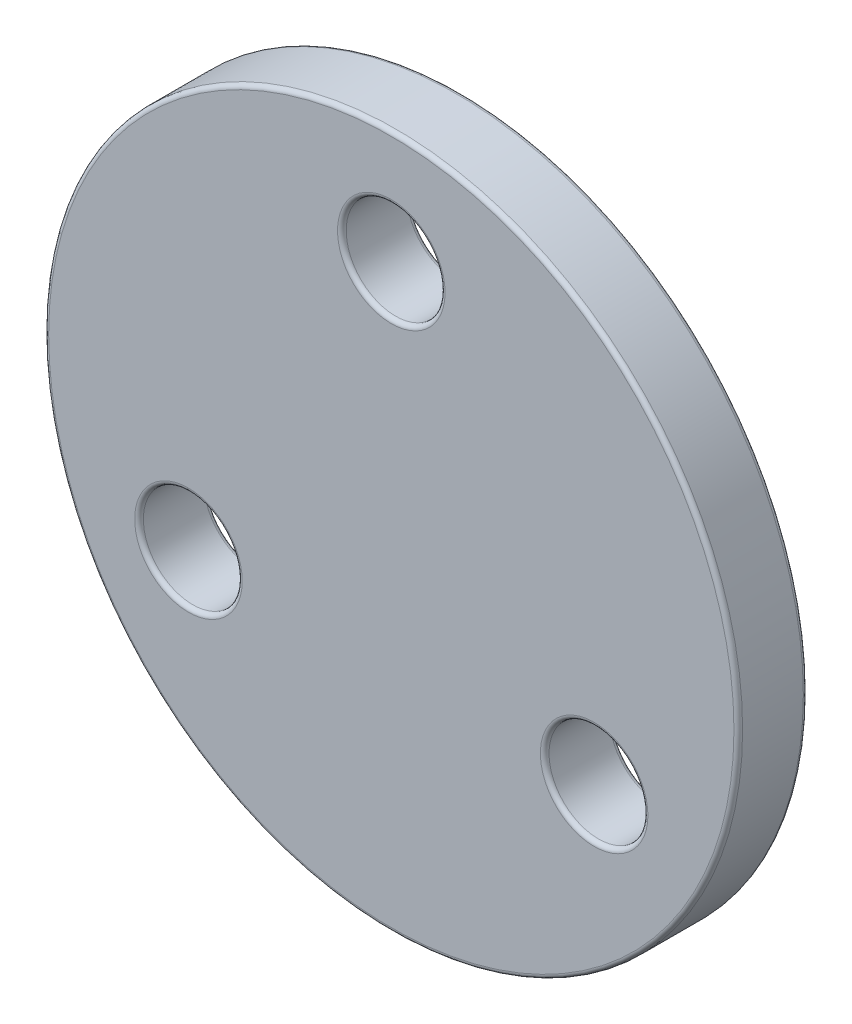
ISO-10303-21;
HEADER;
FILE_DESCRIPTION(('STEP AP214'),'2;1');
FILE_NAME('part.step','',(''),(''),'','','');
FILE_SCHEMA(('AUTOMOTIVE_DESIGN { 1 0 10303 214 1 1 1 1 }'));
ENDSEC;
DATA;
#1=APPLICATION_CONTEXT('core data for automotive mechanical design processes');
#2=APPLICATION_PROTOCOL_DEFINITION('international standard','automotive_design',2000,#1);
#3=PRODUCT_CONTEXT('',#1,'mechanical');
#4=PRODUCT('Part','Part','',(#3));
#5=PRODUCT_RELATED_PRODUCT_CATEGORY('part','',(#4));
#6=PRODUCT_DEFINITION_FORMATION('','',#4);
#7=PRODUCT_DEFINITION_CONTEXT('part definition',#1,'design');
#8=PRODUCT_DEFINITION('design','',#6,#7);
#9=PRODUCT_DEFINITION_SHAPE('','',#8);
#10=(LENGTH_UNIT() NAMED_UNIT(*) SI_UNIT(.MILLI.,.METRE.));
#11=(NAMED_UNIT(*) PLANE_ANGLE_UNIT() SI_UNIT($,.RADIAN.));
#12=(NAMED_UNIT(*) SI_UNIT($,.STERADIAN.) SOLID_ANGLE_UNIT());
#13=UNCERTAINTY_MEASURE_WITH_UNIT(LENGTH_MEASURE(1.E-05),#10,'distance_accuracy_value','');
#14=(GEOMETRIC_REPRESENTATION_CONTEXT(3) GLOBAL_UNCERTAINTY_ASSIGNED_CONTEXT((#13)) GLOBAL_UNIT_ASSIGNED_CONTEXT((#10,
#11,#12)) REPRESENTATION_CONTEXT('',''));
#15=CARTESIAN_POINT('',(0.,0.,0.));
#16=DIRECTION('',(0.,0.,1.));
#17=DIRECTION('',(1.,0.,0.));
#18=AXIS2_PLACEMENT_3D('',#15,#16,#17);
#19=CARTESIAN_POINT('',(0.,0.,4.));
#20=DIRECTION('',(0.,0.,1.));
#21=DIRECTION('',(1.,0.,0.));
#22=AXIS2_PLACEMENT_3D('',#19,#20,#21);
#23=PLANE('',#22);
#24=CARTESIAN_POINT('',(11.6913429510908,-6.7499999999995,4.));
#25=DIRECTION('',(0.,0.,1.));
#26=DIRECTION('',(1.,0.,0.));
#27=AXIS2_PLACEMENT_3D('',#24,#25,#26);
#28=CIRCLE('',#27,3.10000000000074);
#29=CARTESIAN_POINT('',(14.7913429510915,-6.7499999999995,4.));
#30=VERTEX_POINT('',#29);
#31=EDGE_CURVE('E69',#30,#30,#28,.F.);
#32=ORIENTED_EDGE('',*,*,#31,.T.);
#33=EDGE_LOOP('',(#32));
#34=FACE_BOUND('',#33,.T.);
#35=CARTESIAN_POINT('',(-11.6913429510891,-6.7500000000005,4.));
#36=DIRECTION('',(0.,0.,1.));
#37=DIRECTION('',(1.,0.,0.));
#38=AXIS2_PLACEMENT_3D('',#35,#36,#37);
#39=CIRCLE('',#38,3.10000000000109);
#40=CARTESIAN_POINT('',(-8.59134295108796,-6.7500000000005,4.));
#41=VERTEX_POINT('',#40);
#42=EDGE_CURVE('E72',#41,#41,#39,.F.);
#43=ORIENTED_EDGE('',*,*,#42,.T.);
#44=EDGE_LOOP('',(#43));
#45=FACE_BOUND('',#44,.T.);
#46=CARTESIAN_POINT('',(0.,13.5,4.));
#47=DIRECTION('',(0.,0.,1.));
#48=DIRECTION('',(1.,0.,0.));
#49=AXIS2_PLACEMENT_3D('',#46,#47,#48);
#50=CIRCLE('',#49,3.1);
#51=CARTESIAN_POINT('',(3.1,13.5,4.));
#52=VERTEX_POINT('',#51);
#53=EDGE_CURVE('E75',#52,#52,#50,.F.);
#54=ORIENTED_EDGE('',*,*,#53,.T.);
#55=EDGE_LOOP('',(#54));
#56=FACE_BOUND('',#55,.T.);
#57=CARTESIAN_POINT('',(0.,0.,4.));
#58=DIRECTION('',(0.,0.,1.));
#59=DIRECTION('',(1.,0.,0.));
#60=AXIS2_PLACEMENT_3D('',#57,#58,#59);
#61=CIRCLE('',#60,19.75);
#62=CARTESIAN_POINT('',(19.75,0.,4.));
#63=VERTEX_POINT('',#62);
#64=EDGE_CURVE('E78',#63,#63,#61,.T.);
#65=ORIENTED_EDGE('',*,*,#64,.T.);
#66=EDGE_LOOP('',(#65));
#67=FACE_BOUND('',#66,.T.);
#68=ADVANCED_FACE('F31',(#34,#45,#56,#67),#23,.T.);
#69=CARTESIAN_POINT('',(0.,0.,0.));
#70=DIRECTION('',(0.,0.,1.));
#71=DIRECTION('',(1.,0.,0.));
#72=AXIS2_PLACEMENT_3D('',#69,#70,#71);
#73=PLANE('',#72);
#74=CARTESIAN_POINT('',(11.6913429510908,-6.7499999999995,0.));
#75=DIRECTION('',(0.,0.,1.));
#76=DIRECTION('',(1.,0.,0.));
#77=AXIS2_PLACEMENT_3D('',#74,#75,#76);
#78=CIRCLE('',#77,3.10000000000074);
#79=CARTESIAN_POINT('',(14.7913429510915,-6.7499999999995,0.));
#80=VERTEX_POINT('',#79);
#81=EDGE_CURVE('E57',#80,#80,#78,.T.);
#82=ORIENTED_EDGE('',*,*,#81,.T.);
#83=EDGE_LOOP('',(#82));
#84=FACE_BOUND('',#83,.T.);
#85=CARTESIAN_POINT('',(-11.6913429510891,-6.7500000000005,0.));
#86=DIRECTION('',(0.,0.,1.));
#87=DIRECTION('',(1.,0.,0.));
#88=AXIS2_PLACEMENT_3D('',#85,#86,#87);
#89=CIRCLE('',#88,3.10000000000109);
#90=CARTESIAN_POINT('',(-8.59134295108796,-6.7500000000005,0.));
#91=VERTEX_POINT('',#90);
#92=EDGE_CURVE('E60',#91,#91,#89,.T.);
#93=ORIENTED_EDGE('',*,*,#92,.T.);
#94=EDGE_LOOP('',(#93));
#95=FACE_BOUND('',#94,.T.);
#96=CARTESIAN_POINT('',(0.,13.5,0.));
#97=DIRECTION('',(0.,0.,1.));
#98=DIRECTION('',(1.,0.,0.));
#99=AXIS2_PLACEMENT_3D('',#96,#97,#98);
#100=CIRCLE('',#99,3.1);
#101=CARTESIAN_POINT('',(3.1,13.5,0.));
#102=VERTEX_POINT('',#101);
#103=EDGE_CURVE('E63',#102,#102,#100,.T.);
#104=ORIENTED_EDGE('',*,*,#103,.T.);
#105=EDGE_LOOP('',(#104));
#106=FACE_BOUND('',#105,.T.);
#107=CARTESIAN_POINT('',(0.,0.,0.));
#108=DIRECTION('',(0.,0.,1.));
#109=DIRECTION('',(1.,0.,0.));
#110=AXIS2_PLACEMENT_3D('',#107,#108,#109);
#111=CIRCLE('',#110,19.75);
#112=CARTESIAN_POINT('',(19.75,0.,0.));
#113=VERTEX_POINT('',#112);
#114=EDGE_CURVE('E66',#113,#113,#111,.F.);
#115=ORIENTED_EDGE('',*,*,#114,.T.);
#116=EDGE_LOOP('',(#115));
#117=FACE_BOUND('',#116,.T.);
#118=ADVANCED_FACE('F98',(#84,#95,#106,#117),#73,.F.);
#119=CARTESIAN_POINT('',(0.,0.,4.));
#120=DIRECTION('',(0.,0.,-1.));
#121=DIRECTION('',(-1.,0.,0.));
#122=AXIS2_PLACEMENT_3D('',#119,#120,#121);
#123=CYLINDRICAL_SURFACE('',#122,20.);
#124=CARTESIAN_POINT('',(0.,0.,3.75));
#125=DIRECTION('',(0.,0.,1.));
#126=DIRECTION('',(1.,0.,0.));
#127=AXIS2_PLACEMENT_3D('',#124,#125,#126);
#128=CIRCLE('',#127,20.);
#129=CARTESIAN_POINT('',(20.,0.,3.75));
#130=VERTEX_POINT('',#129);
#131=EDGE_CURVE('E10',#130,#130,#128,.F.);
#132=ORIENTED_EDGE('',*,*,#131,.T.);
#133=EDGE_LOOP('',(#132));
#134=FACE_BOUND('',#133,.T.);
#135=CARTESIAN_POINT('',(0.,0.,0.25));
#136=DIRECTION('',(0.,0.,1.));
#137=DIRECTION('',(1.,0.,0.));
#138=AXIS2_PLACEMENT_3D('',#135,#136,#137);
#139=CIRCLE('',#138,20.);
#140=CARTESIAN_POINT('',(20.,0.,0.25));
#141=VERTEX_POINT('',#140);
#142=EDGE_CURVE('E38',#141,#141,#139,.T.);
#143=ORIENTED_EDGE('',*,*,#142,.T.);
#144=EDGE_LOOP('',(#143));
#145=FACE_BOUND('',#144,.T.);
#146=ADVANCED_FACE('F101',(#134,#145),#123,.T.);
#147=CARTESIAN_POINT('',(0.,13.5,12.0610173055297));
#148=DIRECTION('',(0.,0.,-1.));
#149=DIRECTION('',(-1.,0.,0.));
#150=AXIS2_PLACEMENT_3D('',#147,#148,#149);
#151=CYLINDRICAL_SURFACE('',#150,2.85);
#152=CARTESIAN_POINT('',(0.,13.5,3.75));
#153=DIRECTION('',(0.,0.,1.));
#154=DIRECTION('',(1.,0.,0.));
#155=AXIS2_PLACEMENT_3D('',#152,#153,#154);
#156=CIRCLE('',#155,2.85);
#157=CARTESIAN_POINT('',(2.85,13.5,3.75));
#158=VERTEX_POINT('',#157);
#159=EDGE_CURVE('E42',#158,#158,#156,.T.);
#160=ORIENTED_EDGE('',*,*,#159,.T.);
#161=EDGE_LOOP('',(#160));
#162=FACE_BOUND('',#161,.T.);
#163=CARTESIAN_POINT('',(0.,13.5,0.25));
#164=DIRECTION('',(0.,0.,1.));
#165=DIRECTION('',(1.,0.,0.));
#166=AXIS2_PLACEMENT_3D('',#163,#164,#165);
#167=CIRCLE('',#166,2.85);
#168=CARTESIAN_POINT('',(2.85,13.5,0.25));
#169=VERTEX_POINT('',#168);
#170=EDGE_CURVE('E46',#169,#169,#167,.F.);
#171=ORIENTED_EDGE('',*,*,#170,.T.);
#172=EDGE_LOOP('',(#171));
#173=FACE_BOUND('',#172,.T.);
#174=ADVANCED_FACE('F124',(#162,#173),#151,.F.);
#175=CARTESIAN_POINT('',(-11.6913429510891,-6.7500000000005,12.0610173055297));
#176=DIRECTION('',(0.,0.,-1.));
#177=DIRECTION('',(-1.,0.,0.));
#178=AXIS2_PLACEMENT_3D('',#175,#176,#177);
#179=CYLINDRICAL_SURFACE('',#178,2.85000000000109);
#180=CARTESIAN_POINT('',(-11.6913429510891,-6.7500000000005,3.75));
#181=DIRECTION('',(0.,0.,1.));
#182=DIRECTION('',(1.,0.,0.));
#183=AXIS2_PLACEMENT_3D('',#180,#181,#182);
#184=CIRCLE('',#183,2.85000000000109);
#185=CARTESIAN_POINT('',(-8.84134295108796,-6.7500000000005,3.75));
#186=VERTEX_POINT('',#185);
#187=EDGE_CURVE('E51',#186,#186,#184,.T.);
#188=ORIENTED_EDGE('',*,*,#187,.T.);
#189=EDGE_LOOP('',(#188));
#190=FACE_BOUND('',#189,.T.);
#191=CARTESIAN_POINT('',(-11.6913429510891,-6.7500000000005,0.25));
#192=DIRECTION('',(0.,0.,1.));
#193=DIRECTION('',(1.,0.,0.));
#194=AXIS2_PLACEMENT_3D('',#191,#192,#193);
#195=CIRCLE('',#194,2.85000000000109);
#196=CARTESIAN_POINT('',(-8.84134295108796,-6.7500000000005,0.25));
#197=VERTEX_POINT('',#196);
#198=EDGE_CURVE('E54',#197,#197,#195,.F.);
#199=ORIENTED_EDGE('',*,*,#198,.T.);
#200=EDGE_LOOP('',(#199));
#201=FACE_BOUND('',#200,.T.);
#202=ADVANCED_FACE('F151',(#190,#201),#179,.F.);
#203=CARTESIAN_POINT('',(11.6913429510908,-6.7499999999995,12.0610173055297));
#204=DIRECTION('',(0.,0.,-1.));
#205=DIRECTION('',(-1.,0.,0.));
#206=AXIS2_PLACEMENT_3D('',#203,#204,#205);
#207=CYLINDRICAL_SURFACE('',#206,2.85000000000074);
#208=CARTESIAN_POINT('',(11.6913429510908,-6.7499999999995,3.75));
#209=DIRECTION('',(0.,0.,1.));
#210=DIRECTION('',(1.,0.,0.));
#211=AXIS2_PLACEMENT_3D('',#208,#209,#210);
#212=CIRCLE('',#211,2.85000000000074);
#213=CARTESIAN_POINT('',(14.5413429510915,-6.7499999999995,3.75));
#214=VERTEX_POINT('',#213);
#215=EDGE_CURVE('E81',#214,#214,#212,.T.);
#216=ORIENTED_EDGE('',*,*,#215,.T.);
#217=EDGE_LOOP('',(#216));
#218=FACE_BOUND('',#217,.T.);
#219=CARTESIAN_POINT('',(11.6913429510908,-6.7499999999995,0.25));
#220=DIRECTION('',(0.,0.,1.));
#221=DIRECTION('',(1.,0.,0.));
#222=AXIS2_PLACEMENT_3D('',#219,#220,#221);
#223=CIRCLE('',#222,2.85000000000074);
#224=CARTESIAN_POINT('',(14.5413429510915,-6.7499999999995,0.25));
#225=VERTEX_POINT('',#224);
#226=EDGE_CURVE('E84',#225,#225,#223,.F.);
#227=ORIENTED_EDGE('',*,*,#226,.T.);
#228=EDGE_LOOP('',(#227));
#229=FACE_BOUND('',#228,.T.);
#230=ADVANCED_FACE('F88',(#218,#229),#207,.F.);
#231=CARTESIAN_POINT('',(11.6913429510908,-6.7499999999995,3.75));
#232=DIRECTION('',(0.,0.,1.));
#233=DIRECTION('',(1.,0.,0.));
#234=AXIS2_PLACEMENT_3D('',#231,#232,#233);
#235=TOROIDAL_SURFACE('',#234,3.10000000000074,0.25);
#236=ORIENTED_EDGE('',*,*,#31,.F.);
#237=EDGE_LOOP('',(#236));
#238=FACE_BOUND('',#237,.T.);
#239=ORIENTED_EDGE('',*,*,#215,.F.);
#240=EDGE_LOOP('',(#239));
#241=FACE_BOUND('',#240,.T.);
#242=ADVANCED_FACE('F94',(#238,#241),#235,.T.);
#243=CARTESIAN_POINT('',(11.6913429510908,-6.7499999999995,0.25));
#244=DIRECTION('',(0.,0.,1.));
#245=DIRECTION('',(1.,0.,0.));
#246=AXIS2_PLACEMENT_3D('',#243,#244,#245);
#247=TOROIDAL_SURFACE('',#246,3.10000000000074,0.25);
#248=ORIENTED_EDGE('',*,*,#226,.F.);
#249=EDGE_LOOP('',(#248));
#250=FACE_BOUND('',#249,.T.);
#251=ORIENTED_EDGE('',*,*,#81,.F.);
#252=EDGE_LOOP('',(#251));
#253=FACE_BOUND('',#252,.T.);
#254=ADVANCED_FACE('F90',(#250,#253),#247,.T.);
#255=CARTESIAN_POINT('',(-11.6913429510891,-6.7500000000005,3.75));
#256=DIRECTION('',(0.,0.,1.));
#257=DIRECTION('',(1.,0.,0.));
#258=AXIS2_PLACEMENT_3D('',#255,#256,#257);
#259=TOROIDAL_SURFACE('',#258,3.10000000000109,0.25);
#260=ORIENTED_EDGE('',*,*,#42,.F.);
#261=EDGE_LOOP('',(#260));
#262=FACE_BOUND('',#261,.T.);
#263=ORIENTED_EDGE('',*,*,#187,.F.);
#264=EDGE_LOOP('',(#263));
#265=FACE_BOUND('',#264,.T.);
#266=ADVANCED_FACE('F93',(#262,#265),#259,.T.);
#267=CARTESIAN_POINT('',(-11.6913429510891,-6.7500000000005,0.25));
#268=DIRECTION('',(0.,0.,1.));
#269=DIRECTION('',(1.,0.,0.));
#270=AXIS2_PLACEMENT_3D('',#267,#268,#269);
#271=TOROIDAL_SURFACE('',#270,3.10000000000109,0.25);
#272=ORIENTED_EDGE('',*,*,#198,.F.);
#273=EDGE_LOOP('',(#272));
#274=FACE_BOUND('',#273,.T.);
#275=ORIENTED_EDGE('',*,*,#92,.F.);
#276=EDGE_LOOP('',(#275));
#277=FACE_BOUND('',#276,.T.);
#278=ADVANCED_FACE('F134',(#274,#277),#271,.T.);
#279=CARTESIAN_POINT('',(0.,13.5,3.75));
#280=DIRECTION('',(0.,0.,1.));
#281=DIRECTION('',(1.,0.,0.));
#282=AXIS2_PLACEMENT_3D('',#279,#280,#281);
#283=TOROIDAL_SURFACE('',#282,3.1,0.25);
#284=ORIENTED_EDGE('',*,*,#53,.F.);
#285=EDGE_LOOP('',(#284));
#286=FACE_BOUND('',#285,.T.);
#287=ORIENTED_EDGE('',*,*,#159,.F.);
#288=EDGE_LOOP('',(#287));
#289=FACE_BOUND('',#288,.T.);
#290=ADVANCED_FACE('F138',(#286,#289),#283,.T.);
#291=CARTESIAN_POINT('',(0.,13.5,0.25));
#292=DIRECTION('',(0.,0.,1.));
#293=DIRECTION('',(1.,0.,0.));
#294=AXIS2_PLACEMENT_3D('',#291,#292,#293);
#295=TOROIDAL_SURFACE('',#294,3.1,0.25);
#296=ORIENTED_EDGE('',*,*,#170,.F.);
#297=EDGE_LOOP('',(#296));
#298=FACE_BOUND('',#297,.T.);
#299=ORIENTED_EDGE('',*,*,#103,.F.);
#300=EDGE_LOOP('',(#299));
#301=FACE_BOUND('',#300,.T.);
#302=ADVANCED_FACE('F115',(#298,#301),#295,.T.);
#303=CARTESIAN_POINT('',(0.,0.,3.75));
#304=DIRECTION('',(0.,0.,1.));
#305=DIRECTION('',(1.,0.,0.));
#306=AXIS2_PLACEMENT_3D('',#303,#304,#305);
#307=TOROIDAL_SURFACE('',#306,19.75,0.25);
#308=ORIENTED_EDGE('',*,*,#131,.F.);
#309=EDGE_LOOP('',(#308));
#310=FACE_BOUND('',#309,.T.);
#311=ORIENTED_EDGE('',*,*,#64,.F.);
#312=EDGE_LOOP('',(#311));
#313=FACE_BOUND('',#312,.T.);
#314=ADVANCED_FACE('F111',(#310,#313),#307,.T.);
#315=CARTESIAN_POINT('',(0.,0.,0.25));
#316=DIRECTION('',(0.,0.,1.));
#317=DIRECTION('',(1.,0.,0.));
#318=AXIS2_PLACEMENT_3D('',#315,#316,#317);
#319=TOROIDAL_SURFACE('',#318,19.75,0.25);
#320=ORIENTED_EDGE('',*,*,#114,.F.);
#321=EDGE_LOOP('',(#320));
#322=FACE_BOUND('',#321,.T.);
#323=ORIENTED_EDGE('',*,*,#142,.F.);
#324=EDGE_LOOP('',(#323));
#325=FACE_BOUND('',#324,.T.);
#326=ADVANCED_FACE('F33',(#322,#325),#319,.T.);
#327=CLOSED_SHELL('',(#68,#118,#146,#174,#202,#230,#242,#254,#266,#278,#290,#302,#314,#326));
#328=MANIFOLD_SOLID_BREP('B2',#327);
#329=ADVANCED_BREP_SHAPE_REPRESENTATION('',(#18,#328),#14);
#330=SHAPE_DEFINITION_REPRESENTATION(#9,#329);
ENDSEC;
END-ISO-10303-21;
